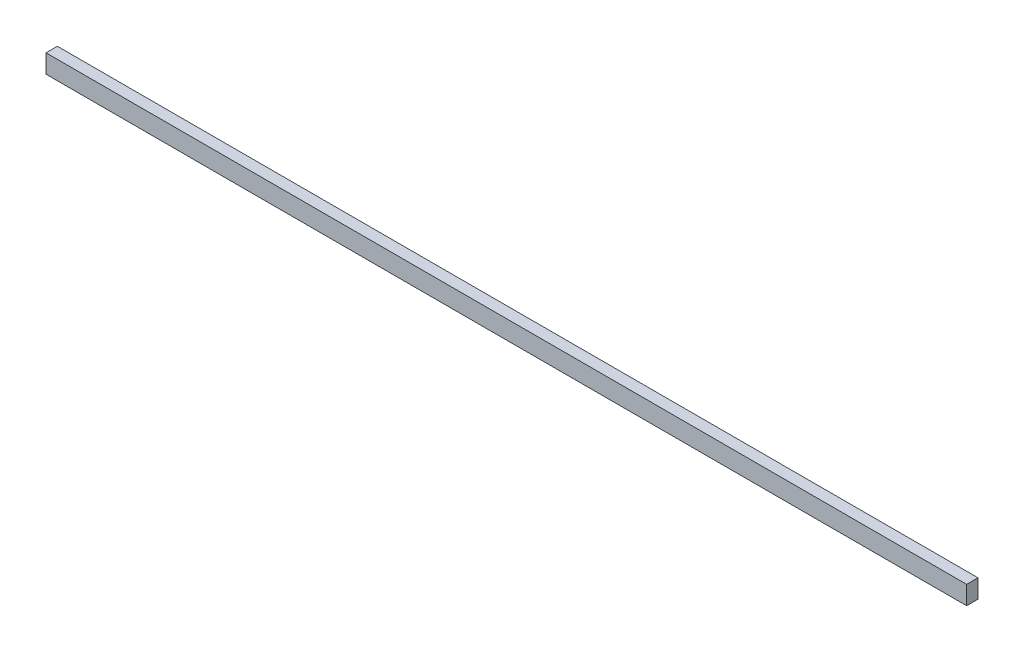
ISO-10303-21;
HEADER;
FILE_DESCRIPTION(('STEP AP214'),'2;1');
FILE_NAME('part.step','',(''),(''),'','','');
FILE_SCHEMA(('AUTOMOTIVE_DESIGN { 1 0 10303 214 1 1 1 1 }'));
ENDSEC;
DATA;
#1=APPLICATION_CONTEXT('core data for automotive mechanical design processes');
#2=APPLICATION_PROTOCOL_DEFINITION('international standard','automotive_design',2000,#1);
#3=PRODUCT_CONTEXT('',#1,'mechanical');
#4=PRODUCT('Part','Part','',(#3));
#5=PRODUCT_RELATED_PRODUCT_CATEGORY('part','',(#4));
#6=PRODUCT_DEFINITION_FORMATION('','',#4);
#7=PRODUCT_DEFINITION_CONTEXT('part definition',#1,'design');
#8=PRODUCT_DEFINITION('design','',#6,#7);
#9=PRODUCT_DEFINITION_SHAPE('','',#8);
#10=(LENGTH_UNIT() NAMED_UNIT(*) SI_UNIT(.MILLI.,.METRE.));
#11=(NAMED_UNIT(*) PLANE_ANGLE_UNIT() SI_UNIT($,.RADIAN.));
#12=(NAMED_UNIT(*) SI_UNIT($,.STERADIAN.) SOLID_ANGLE_UNIT());
#13=UNCERTAINTY_MEASURE_WITH_UNIT(LENGTH_MEASURE(1.E-05),#10,'distance_accuracy_value','');
#14=(GEOMETRIC_REPRESENTATION_CONTEXT(3) GLOBAL_UNCERTAINTY_ASSIGNED_CONTEXT((#13)) GLOBAL_UNIT_ASSIGNED_CONTEXT((#10,
#11,#12)) REPRESENTATION_CONTEXT('',''));
#15=CARTESIAN_POINT('',(0.,0.,0.));
#16=DIRECTION('',(0.,0.,1.));
#17=DIRECTION('',(1.,0.,0.));
#18=AXIS2_PLACEMENT_3D('',#15,#16,#17);
#19=CARTESIAN_POINT('',(0.,0.,5.83));
#20=DIRECTION('',(1.,0.,0.));
#21=DIRECTION('',(0.,0.,-1.));
#22=AXIS2_PLACEMENT_3D('',#19,#20,#21);
#23=PLANE('',#22);
#24=DIRECTION('',(0.,-1.,0.));
#25=VECTOR('',#24,1.);
#26=CARTESIAN_POINT('',(0.,0.,0.));
#27=LINE('',#26,#25);
#28=CARTESIAN_POINT('',(0.,9.525,0.));
#29=VERTEX_POINT('',#28);
#30=CARTESIAN_POINT('',(0.,0.,0.));
#31=VERTEX_POINT('',#30);
#32=EDGE_CURVE('E111',#29,#31,#27,.T.);
#33=ORIENTED_EDGE('',*,*,#32,.T.);
#34=DIRECTION('',(0.,0.,-1.));
#35=VECTOR('',#34,1.);
#36=CARTESIAN_POINT('',(0.,0.,5.83));
#37=LINE('',#36,#35);
#38=CARTESIAN_POINT('',(0.,0.,5.83));
#39=VERTEX_POINT('',#38);
#40=EDGE_CURVE('E11',#39,#31,#37,.T.);
#41=ORIENTED_EDGE('',*,*,#40,.F.);
#42=DIRECTION('',(0.,-1.,0.));
#43=VECTOR('',#42,1.);
#44=CARTESIAN_POINT('',(0.,0.,5.83));
#45=LINE('',#44,#43);
#46=CARTESIAN_POINT('',(0.,9.525,5.83));
#47=VERTEX_POINT('',#46);
#48=EDGE_CURVE('E95',#47,#39,#45,.T.);
#49=ORIENTED_EDGE('',*,*,#48,.F.);
#50=DIRECTION('',(0.,0.,-1.));
#51=VECTOR('',#50,1.);
#52=CARTESIAN_POINT('',(0.,9.525,5.83));
#53=LINE('',#52,#51);
#54=EDGE_CURVE('E107',#47,#29,#53,.T.);
#55=ORIENTED_EDGE('',*,*,#54,.T.);
#56=EDGE_LOOP('',(#33,#41,#49,#55));
#57=FACE_BOUND('',#56,.T.);
#58=ADVANCED_FACE('F43',(#57),#23,.F.);
#59=CARTESIAN_POINT('',(0.,0.,5.83));
#60=DIRECTION('',(0.,1.,0.));
#61=DIRECTION('',(0.,0.,1.));
#62=AXIS2_PLACEMENT_3D('',#59,#60,#61);
#63=PLANE('',#62);
#64=DIRECTION('',(1.,0.,0.));
#65=VECTOR('',#64,1.);
#66=CARTESIAN_POINT('',(0.,0.,0.));
#67=LINE('',#66,#65);
#68=CARTESIAN_POINT('',(472.77,0.,0.));
#69=VERTEX_POINT('',#68);
#70=EDGE_CURVE('E100',#31,#69,#67,.T.);
#71=ORIENTED_EDGE('',*,*,#70,.T.);
#72=DIRECTION('',(0.,0.,-1.));
#73=VECTOR('',#72,1.);
#74=CARTESIAN_POINT('',(472.77,0.,5.83));
#75=LINE('',#74,#73);
#76=CARTESIAN_POINT('',(472.77,0.,5.83));
#77=VERTEX_POINT('',#76);
#78=EDGE_CURVE('E52',#77,#69,#75,.T.);
#79=ORIENTED_EDGE('',*,*,#78,.F.);
#80=DIRECTION('',(1.,0.,0.));
#81=VECTOR('',#80,1.);
#82=CARTESIAN_POINT('',(0.,0.,5.83));
#83=LINE('',#82,#81);
#84=EDGE_CURVE('E90',#39,#77,#83,.T.);
#85=ORIENTED_EDGE('',*,*,#84,.F.);
#86=ORIENTED_EDGE('',*,*,#40,.T.);
#87=EDGE_LOOP('',(#71,#79,#85,#86));
#88=FACE_BOUND('',#87,.T.);
#89=ADVANCED_FACE('F99',(#88),#63,.F.);
#90=CARTESIAN_POINT('',(472.77,0.,5.83));
#91=DIRECTION('',(-1.,0.,0.));
#92=DIRECTION('',(0.,0.,1.));
#93=AXIS2_PLACEMENT_3D('',#90,#91,#92);
#94=PLANE('',#93);
#95=DIRECTION('',(0.,1.,0.));
#96=VECTOR('',#95,1.);
#97=CARTESIAN_POINT('',(472.77,0.,0.));
#98=LINE('',#97,#96);
#99=CARTESIAN_POINT('',(472.77,9.525,0.));
#100=VERTEX_POINT('',#99);
#101=EDGE_CURVE('E77',#69,#100,#98,.T.);
#102=ORIENTED_EDGE('',*,*,#101,.T.);
#103=DIRECTION('',(0.,0.,-1.));
#104=VECTOR('',#103,1.);
#105=CARTESIAN_POINT('',(472.77,9.525,5.83));
#106=LINE('',#105,#104);
#107=CARTESIAN_POINT('',(472.77,9.525,5.83));
#108=VERTEX_POINT('',#107);
#109=EDGE_CURVE('E102',#108,#100,#106,.T.);
#110=ORIENTED_EDGE('',*,*,#109,.F.);
#111=DIRECTION('',(0.,1.,0.));
#112=VECTOR('',#111,1.);
#113=CARTESIAN_POINT('',(472.77,0.,5.83));
#114=LINE('',#113,#112);
#115=EDGE_CURVE('E93',#77,#108,#114,.T.);
#116=ORIENTED_EDGE('',*,*,#115,.F.);
#117=ORIENTED_EDGE('',*,*,#78,.T.);
#118=EDGE_LOOP('',(#102,#110,#116,#117));
#119=FACE_BOUND('',#118,.T.);
#120=ADVANCED_FACE('F103',(#119),#94,.F.);
#121=CARTESIAN_POINT('',(0.,9.525,5.83));
#122=DIRECTION('',(0.,-1.,0.));
#123=DIRECTION('',(0.,0.,-1.));
#124=AXIS2_PLACEMENT_3D('',#121,#122,#123);
#125=PLANE('',#124);
#126=DIRECTION('',(-1.,0.,0.));
#127=VECTOR('',#126,1.);
#128=CARTESIAN_POINT('',(0.,9.525,0.));
#129=LINE('',#128,#127);
#130=EDGE_CURVE('E83',#100,#29,#129,.T.);
#131=ORIENTED_EDGE('',*,*,#130,.T.);
#132=ORIENTED_EDGE('',*,*,#54,.F.);
#133=DIRECTION('',(-1.,0.,0.));
#134=VECTOR('',#133,1.);
#135=CARTESIAN_POINT('',(0.,9.525,5.83));
#136=LINE('',#135,#134);
#137=EDGE_CURVE('E60',#108,#47,#136,.T.);
#138=ORIENTED_EDGE('',*,*,#137,.F.);
#139=ORIENTED_EDGE('',*,*,#109,.T.);
#140=EDGE_LOOP('',(#131,#132,#138,#139));
#141=FACE_BOUND('',#140,.T.);
#142=ADVANCED_FACE('F124',(#141),#125,.F.);
#143=CARTESIAN_POINT('',(0.,0.,5.83));
#144=DIRECTION('',(0.,0.,-1.));
#145=DIRECTION('',(-1.,0.,0.));
#146=AXIS2_PLACEMENT_3D('',#143,#144,#145);
#147=PLANE('',#146);
#148=ORIENTED_EDGE('',*,*,#48,.T.);
#149=ORIENTED_EDGE('',*,*,#84,.T.);
#150=ORIENTED_EDGE('',*,*,#115,.T.);
#151=ORIENTED_EDGE('',*,*,#137,.T.);
#152=EDGE_LOOP('',(#148,#149,#150,#151));
#153=FACE_BOUND('',#152,.T.);
#154=ADVANCED_FACE('F91',(#153),#147,.F.);
#155=CARTESIAN_POINT('',(0.,0.,0.));
#156=DIRECTION('',(0.,0.,-1.));
#157=DIRECTION('',(-1.,0.,0.));
#158=AXIS2_PLACEMENT_3D('',#155,#156,#157);
#159=PLANE('',#158);
#160=ORIENTED_EDGE('',*,*,#32,.F.);
#161=ORIENTED_EDGE('',*,*,#130,.F.);
#162=ORIENTED_EDGE('',*,*,#101,.F.);
#163=ORIENTED_EDGE('',*,*,#70,.F.);
#164=EDGE_LOOP('',(#160,#161,#162,#163));
#165=FACE_BOUND('',#164,.T.);
#166=ADVANCED_FACE('F127',(#165),#159,.T.);
#167=CLOSED_SHELL('',(#58,#89,#120,#142,#154,#166));
#168=MANIFOLD_SOLID_BREP('B2',#167);
#169=ADVANCED_BREP_SHAPE_REPRESENTATION('',(#18,#168),#14);
#170=SHAPE_DEFINITION_REPRESENTATION(#9,#169);
ENDSEC;
END-ISO-10303-21;
